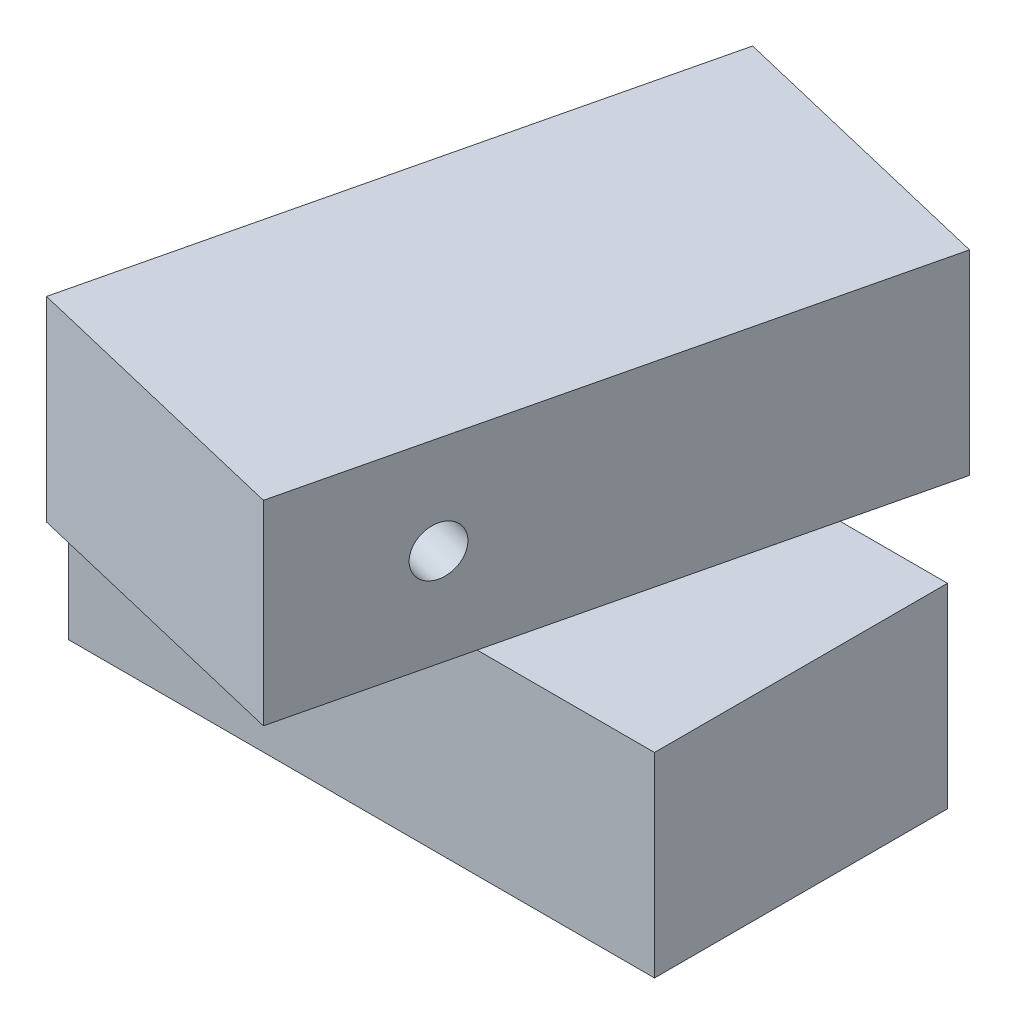
ISO-10303-21;
HEADER;
FILE_DESCRIPTION(('STEP AP214'),'2;1');
FILE_NAME('part.step','',(''),(''),'','','');
FILE_SCHEMA(('AUTOMOTIVE_DESIGN { 1 0 10303 214 1 1 1 1 }'));
ENDSEC;
DATA;
#1=APPLICATION_CONTEXT('core data for automotive mechanical design processes');
#2=APPLICATION_PROTOCOL_DEFINITION('international standard','automotive_design',2000,#1);
#3=PRODUCT_CONTEXT('',#1,'mechanical');
#4=PRODUCT('Part','Part','',(#3));
#5=PRODUCT_RELATED_PRODUCT_CATEGORY('part','',(#4));
#6=PRODUCT_DEFINITION_FORMATION('','',#4);
#7=PRODUCT_DEFINITION_CONTEXT('part definition',#1,'design');
#8=PRODUCT_DEFINITION('design','',#6,#7);
#9=PRODUCT_DEFINITION_SHAPE('','',#8);
#10=(LENGTH_UNIT() NAMED_UNIT(*) SI_UNIT(.MILLI.,.METRE.));
#11=(NAMED_UNIT(*) PLANE_ANGLE_UNIT() SI_UNIT($,.RADIAN.));
#12=(NAMED_UNIT(*) SI_UNIT($,.STERADIAN.) SOLID_ANGLE_UNIT());
#13=UNCERTAINTY_MEASURE_WITH_UNIT(LENGTH_MEASURE(1.E-05),#10,'distance_accuracy_value','');
#14=(GEOMETRIC_REPRESENTATION_CONTEXT(3) GLOBAL_UNCERTAINTY_ASSIGNED_CONTEXT((#13)) GLOBAL_UNIT_ASSIGNED_CONTEXT((#10,
#11,#12)) REPRESENTATION_CONTEXT('',''));
#15=CARTESIAN_POINT('',(0.,0.,0.));
#16=DIRECTION('',(0.,0.,1.));
#17=DIRECTION('',(1.,0.,0.));
#18=AXIS2_PLACEMENT_3D('',#15,#16,#17);
#19=CARTESIAN_POINT('',(-60.,20.,30.));
#20=DIRECTION('',(0.,-1.,0.));
#21=DIRECTION('',(0.,0.,-1.));
#22=AXIS2_PLACEMENT_3D('',#19,#20,#21);
#23=PLANE('',#22);
#24=DIRECTION('',(0.232341226421482,0.,-0.972634337510743));
#25=VECTOR('',#24,1.);
#26=CARTESIAN_POINT('',(43.1195037106112,20.,-51.3878234580001));
#27=LINE('',#26,#25);
#28=CARTESIAN_POINT('',(23.6777196929891,20.,30.));
#29=VERTEX_POINT('',#28);
#30=CARTESIAN_POINT('',(38.0104170363367,20.,-30.));
#31=VERTEX_POINT('',#30);
#32=EDGE_CURVE('E11',#29,#31,#27,.T.);
#33=ORIENTED_EDGE('',*,*,#32,.F.);
#34=DIRECTION('',(-1.,0.,0.));
#35=VECTOR('',#34,1.);
#36=CARTESIAN_POINT('',(-60.,20.,30.));
#37=LINE('',#36,#35);
#38=CARTESIAN_POINT('',(60.,20.,30.));
#39=VERTEX_POINT('',#38);
#40=EDGE_CURVE('E152',#39,#29,#37,.T.);
#41=ORIENTED_EDGE('',*,*,#40,.F.);
#42=DIRECTION('',(0.,0.,-1.));
#43=VECTOR('',#42,1.);
#44=CARTESIAN_POINT('',(60.,20.,30.));
#45=LINE('',#44,#43);
#46=CARTESIAN_POINT('',(60.,20.,-30.));
#47=VERTEX_POINT('',#46);
#48=EDGE_CURVE('E37',#39,#47,#45,.T.);
#49=ORIENTED_EDGE('',*,*,#48,.T.);
#50=DIRECTION('',(-1.,0.,0.));
#51=VECTOR('',#50,1.);
#52=CARTESIAN_POINT('',(-60.,20.,-30.));
#53=LINE('',#52,#51);
#54=EDGE_CURVE('E160',#47,#31,#53,.T.);
#55=ORIENTED_EDGE('',*,*,#54,.T.);
#56=EDGE_LOOP('',(#33,#41,#49,#55));
#57=FACE_BOUND('',#56,.T.);
#58=ADVANCED_FACE('F33',(#57),#23,.F.);
#59=DIRECTION('',(-0.232341226421482,0.,0.972634337510743));
#60=VECTOR('',#59,1.);
#61=CARTESIAN_POINT('',(-15.2385565400334,20.,-65.328297043289));
#62=LINE('',#61,#60);
#63=CARTESIAN_POINT('',(-23.6777196929891,20.,-30.));
#64=VERTEX_POINT('',#63);
#65=CARTESIAN_POINT('',(-38.0104170363368,20.,30.));
#66=VERTEX_POINT('',#65);
#67=EDGE_CURVE('E42',#64,#66,#62,.T.);
#68=ORIENTED_EDGE('',*,*,#67,.F.);
#69=CARTESIAN_POINT('',(-60.,20.,-30.));
#70=VERTEX_POINT('',#69);
#71=EDGE_CURVE('E141',#64,#70,#53,.T.);
#72=ORIENTED_EDGE('',*,*,#71,.T.);
#73=DIRECTION('',(0.,0.,-1.));
#74=VECTOR('',#73,1.);
#75=CARTESIAN_POINT('',(-60.,20.,30.));
#76=LINE('',#75,#74);
#77=CARTESIAN_POINT('',(-60.,20.,30.));
#78=VERTEX_POINT('',#77);
#79=EDGE_CURVE('E170',#78,#70,#76,.T.);
#80=ORIENTED_EDGE('',*,*,#79,.F.);
#81=EDGE_CURVE('E150',#66,#78,#37,.T.);
#82=ORIENTED_EDGE('',*,*,#81,.F.);
#83=EDGE_LOOP('',(#68,#72,#80,#82));
#84=FACE_BOUND('',#83,.T.);
#85=ADVANCED_FACE('F217',(#84),#23,.F.);
#86=CARTESIAN_POINT('',(60.,-20.,30.));
#87=DIRECTION('',(-1.,0.,0.));
#88=DIRECTION('',(0.,0.,1.));
#89=AXIS2_PLACEMENT_3D('',#86,#87,#88);
#90=PLANE('',#89);
#91=DIRECTION('',(0.,1.,0.));
#92=VECTOR('',#91,1.);
#93=CARTESIAN_POINT('',(60.,-20.,-30.));
#94=LINE('',#93,#92);
#95=CARTESIAN_POINT('',(60.,-20.,-30.));
#96=VERTEX_POINT('',#95);
#97=EDGE_CURVE('E138',#96,#47,#94,.T.);
#98=ORIENTED_EDGE('',*,*,#97,.T.);
#99=ORIENTED_EDGE('',*,*,#48,.F.);
#100=DIRECTION('',(0.,1.,0.));
#101=VECTOR('',#100,1.);
#102=CARTESIAN_POINT('',(60.,-20.,30.));
#103=LINE('',#102,#101);
#104=CARTESIAN_POINT('',(60.,-20.,30.));
#105=VERTEX_POINT('',#104);
#106=EDGE_CURVE('E147',#105,#39,#103,.T.);
#107=ORIENTED_EDGE('',*,*,#106,.F.);
#108=DIRECTION('',(0.,0.,-1.));
#109=VECTOR('',#108,1.);
#110=CARTESIAN_POINT('',(60.,-20.,30.));
#111=LINE('',#110,#109);
#112=EDGE_CURVE('E158',#105,#96,#111,.T.);
#113=ORIENTED_EDGE('',*,*,#112,.T.);
#114=EDGE_LOOP('',(#98,#99,#107,#113));
#115=FACE_BOUND('',#114,.T.);
#116=ADVANCED_FACE('F35',(#115),#90,.F.);
#117=CARTESIAN_POINT('',(-60.,-20.,30.));
#118=DIRECTION('',(1.,0.,0.));
#119=DIRECTION('',(0.,0.,-1.));
#120=AXIS2_PLACEMENT_3D('',#117,#118,#119);
#121=PLANE('',#120);
#122=DIRECTION('',(0.,-1.,0.));
#123=VECTOR('',#122,1.);
#124=CARTESIAN_POINT('',(-60.,-20.,-30.));
#125=LINE('',#124,#123);
#126=CARTESIAN_POINT('',(-60.,-20.,-30.));
#127=VERTEX_POINT('',#126);
#128=EDGE_CURVE('E162',#70,#127,#125,.T.);
#129=ORIENTED_EDGE('',*,*,#128,.T.);
#130=DIRECTION('',(0.,0.,-1.));
#131=VECTOR('',#130,1.);
#132=CARTESIAN_POINT('',(-60.,-20.,30.));
#133=LINE('',#132,#131);
#134=CARTESIAN_POINT('',(-60.,-20.,30.));
#135=VERTEX_POINT('',#134);
#136=EDGE_CURVE('E168',#135,#127,#133,.T.);
#137=ORIENTED_EDGE('',*,*,#136,.F.);
#138=DIRECTION('',(0.,-1.,0.));
#139=VECTOR('',#138,1.);
#140=CARTESIAN_POINT('',(-60.,-20.,30.));
#141=LINE('',#140,#139);
#142=EDGE_CURVE('E154',#78,#135,#141,.T.);
#143=ORIENTED_EDGE('',*,*,#142,.F.);
#144=ORIENTED_EDGE('',*,*,#79,.T.);
#145=EDGE_LOOP('',(#129,#137,#143,#144));
#146=FACE_BOUND('',#145,.T.);
#147=ADVANCED_FACE('F222',(#146),#121,.F.);
#148=CARTESIAN_POINT('',(-60.,-20.,30.));
#149=DIRECTION('',(0.,1.,0.));
#150=DIRECTION('',(0.,0.,1.));
#151=AXIS2_PLACEMENT_3D('',#148,#149,#150);
#152=PLANE('',#151);
#153=DIRECTION('',(1.,0.,0.));
#154=VECTOR('',#153,1.);
#155=CARTESIAN_POINT('',(-60.,-20.,-30.));
#156=LINE('',#155,#154);
#157=EDGE_CURVE('E151',#127,#96,#156,.T.);
#158=ORIENTED_EDGE('',*,*,#157,.T.);
#159=ORIENTED_EDGE('',*,*,#112,.F.);
#160=DIRECTION('',(1.,0.,0.));
#161=VECTOR('',#160,1.);
#162=CARTESIAN_POINT('',(-60.,-20.,30.));
#163=LINE('',#162,#161);
#164=EDGE_CURVE('E157',#135,#105,#163,.T.);
#165=ORIENTED_EDGE('',*,*,#164,.F.);
#166=ORIENTED_EDGE('',*,*,#136,.T.);
#167=EDGE_LOOP('',(#158,#159,#165,#166));
#168=FACE_BOUND('',#167,.T.);
#169=ADVANCED_FACE('F225',(#168),#152,.F.);
#170=CARTESIAN_POINT('',(0.,0.,30.));
#171=DIRECTION('',(0.,0.,-1.));
#172=DIRECTION('',(-1.,0.,0.));
#173=AXIS2_PLACEMENT_3D('',#170,#171,#172);
#174=PLANE('',#173);
#175=ORIENTED_EDGE('',*,*,#106,.T.);
#176=ORIENTED_EDGE('',*,*,#40,.T.);
#177=EDGE_CURVE('E155',#29,#66,#37,.T.);
#178=ORIENTED_EDGE('',*,*,#177,.T.);
#179=ORIENTED_EDGE('',*,*,#81,.T.);
#180=ORIENTED_EDGE('',*,*,#142,.T.);
#181=ORIENTED_EDGE('',*,*,#164,.T.);
#182=EDGE_LOOP('',(#175,#176,#178,#179,#180,#181));
#183=FACE_BOUND('',#182,.T.);
#184=ADVANCED_FACE('F229',(#183),#174,.F.);
#185=CARTESIAN_POINT('',(0.,0.,-30.));
#186=DIRECTION('',(0.,0.,-1.));
#187=DIRECTION('',(-1.,0.,0.));
#188=AXIS2_PLACEMENT_3D('',#185,#186,#187);
#189=PLANE('',#188);
#190=ORIENTED_EDGE('',*,*,#97,.F.);
#191=ORIENTED_EDGE('',*,*,#157,.F.);
#192=ORIENTED_EDGE('',*,*,#128,.F.);
#193=ORIENTED_EDGE('',*,*,#71,.F.);
#194=EDGE_CURVE('E163',#31,#64,#53,.T.);
#195=ORIENTED_EDGE('',*,*,#194,.F.);
#196=ORIENTED_EDGE('',*,*,#54,.F.);
#197=EDGE_LOOP('',(#190,#191,#192,#193,#195,#196));
#198=FACE_BOUND('',#197,.T.);
#199=ADVANCED_FACE('F219',(#198),#189,.T.);
#200=CARTESIAN_POINT('',(0.,20.,0.));
#201=DIRECTION('',(0.,-1.,0.));
#202=DIRECTION('',(0.,0.,-1.));
#203=AXIS2_PLACEMENT_3D('',#200,#201,#202);
#204=PLANE('',#203);
#205=ORIENTED_EDGE('',*,*,#177,.F.);
#206=CARTESIAN_POINT('',(15.2385565400334,20.,65.328297043289));
#207=VERTEX_POINT('',#206);
#208=EDGE_CURVE('E44',#207,#29,#27,.T.);
#209=ORIENTED_EDGE('',*,*,#208,.F.);
#210=DIRECTION('',(0.972634337510743,0.,0.232341226421482));
#211=VECTOR('',#210,1.);
#212=CARTESIAN_POINT('',(-43.1195037106112,20.,51.3878234580001));
#213=LINE('',#212,#211);
#214=CARTESIAN_POINT('',(-43.1195037106112,20.,51.3878234580001));
#215=VERTEX_POINT('',#214);
#216=EDGE_CURVE('E183',#215,#207,#213,.T.);
#217=ORIENTED_EDGE('',*,*,#216,.F.);
#218=EDGE_CURVE('E180',#66,#215,#62,.T.);
#219=ORIENTED_EDGE('',*,*,#218,.F.);
#220=EDGE_LOOP('',(#205,#209,#217,#219));
#221=FACE_BOUND('',#220,.T.);
#222=ADVANCED_FACE('F230',(#221),#204,.T.);
#223=CARTESIAN_POINT('',(-15.2385565400334,60.,-65.328297043289));
#224=DIRECTION('',(-0.232341226421481,0.,0.972634337510743));
#225=DIRECTION('',(0.972634337510743,0.,0.232341226421481));
#226=AXIS2_PLACEMENT_3D('',#223,#224,#225);
#227=PLANE('',#226);
#228=DIRECTION('',(-0.972634337510743,0.,-0.232341226421481));
#229=VECTOR('',#228,1.);
#230=CARTESIAN_POINT('',(-15.2385565400334,20.,-65.328297043289));
#231=LINE('',#230,#229);
#232=CARTESIAN_POINT('',(43.1195037106112,20.,-51.3878234580001));
#233=VERTEX_POINT('',#232);
#234=CARTESIAN_POINT('',(-15.2385565400334,20.,-65.328297043289));
#235=VERTEX_POINT('',#234);
#236=EDGE_CURVE('E137',#233,#235,#231,.T.);
#237=ORIENTED_EDGE('',*,*,#236,.T.);
#238=DIRECTION('',(0.,-1.,0.));
#239=VECTOR('',#238,1.);
#240=CARTESIAN_POINT('',(-15.2385565400334,60.,-65.328297043289));
#241=LINE('',#240,#239);
#242=CARTESIAN_POINT('',(-15.2385565400334,60.,-65.328297043289));
#243=VERTEX_POINT('',#242);
#244=EDGE_CURVE('E118',#243,#235,#241,.T.);
#245=ORIENTED_EDGE('',*,*,#244,.F.);
#246=DIRECTION('',(-0.972634337510743,0.,-0.232341226421481));
#247=VECTOR('',#246,1.);
#248=CARTESIAN_POINT('',(-15.2385565400334,60.,-65.328297043289));
#249=LINE('',#248,#247);
#250=CARTESIAN_POINT('',(43.1195037106112,60.,-51.3878234580001));
#251=VERTEX_POINT('',#250);
#252=EDGE_CURVE('E125',#251,#243,#249,.T.);
#253=ORIENTED_EDGE('',*,*,#252,.F.);
#254=DIRECTION('',(0.,-1.,0.));
#255=VECTOR('',#254,1.);
#256=CARTESIAN_POINT('',(43.1195037106112,60.,-51.3878234580001));
#257=LINE('',#256,#255);
#258=EDGE_CURVE('E191',#251,#233,#257,.T.);
#259=ORIENTED_EDGE('',*,*,#258,.T.);
#260=EDGE_LOOP('',(#237,#245,#253,#259));
#261=FACE_BOUND('',#260,.T.);
#262=ADVANCED_FACE('F135',(#261),#227,.F.);
#263=CARTESIAN_POINT('',(-15.2385565400334,60.,-65.328297043289));
#264=DIRECTION('',(0.972634337510743,0.,0.232341226421482));
#265=DIRECTION('',(0.232341226421482,0.,-0.972634337510743));
#266=AXIS2_PLACEMENT_3D('',#263,#264,#265);
#267=PLANE('',#266);
#268=CARTESIAN_POINT('',(-36.204693437049,40.,22.4408216149521));
#269=DIRECTION('',(0.972634337510743,0.,0.232341226421482));
#270=DIRECTION('',(0.232341226421482,0.,-0.972634337510743));
#271=AXIS2_PLACEMENT_3D('',#268,#269,#270);
#272=CIRCLE('',#271,5.00000000000001);
#273=CARTESIAN_POINT('',(-35.0429873049416,40.,17.5776499273983));
#274=VERTEX_POINT('',#273);
#275=EDGE_CURVE('E185',#274,#274,#272,.T.);
#276=ORIENTED_EDGE('',*,*,#275,.T.);
#277=EDGE_LOOP('',(#276));
#278=FACE_BOUND('',#277,.T.);
#279=EDGE_CURVE('E179',#235,#64,#62,.T.);
#280=ORIENTED_EDGE('',*,*,#279,.T.);
#281=ORIENTED_EDGE('',*,*,#67,.T.);
#282=ORIENTED_EDGE('',*,*,#218,.T.);
#283=DIRECTION('',(0.,-1.,0.));
#284=VECTOR('',#283,1.);
#285=CARTESIAN_POINT('',(-43.1195037106112,60.,51.3878234580001));
#286=LINE('',#285,#284);
#287=CARTESIAN_POINT('',(-43.1195037106112,60.,51.3878234580001));
#288=VERTEX_POINT('',#287);
#289=EDGE_CURVE('E121',#288,#215,#286,.T.);
#290=ORIENTED_EDGE('',*,*,#289,.F.);
#291=DIRECTION('',(-0.232341226421482,0.,0.972634337510743));
#292=VECTOR('',#291,1.);
#293=CARTESIAN_POINT('',(-15.2385565400334,60.,-65.328297043289));
#294=LINE('',#293,#292);
#295=EDGE_CURVE('E113',#243,#288,#294,.T.);
#296=ORIENTED_EDGE('',*,*,#295,.F.);
#297=ORIENTED_EDGE('',*,*,#244,.T.);
#298=EDGE_LOOP('',(#280,#281,#282,#290,#296,#297));
#299=FACE_BOUND('',#298,.T.);
#300=ADVANCED_FACE('F116',(#278,#299),#267,.F.);
#301=CARTESIAN_POINT('',(-43.1195037106112,60.,51.3878234580001));
#302=DIRECTION('',(0.232341226421482,0.,-0.972634337510743));
#303=DIRECTION('',(-0.972634337510743,0.,-0.232341226421482));
#304=AXIS2_PLACEMENT_3D('',#301,#302,#303);
#305=PLANE('',#304);
#306=ORIENTED_EDGE('',*,*,#216,.T.);
#307=DIRECTION('',(0.,-1.,0.));
#308=VECTOR('',#307,1.);
#309=CARTESIAN_POINT('',(15.2385565400334,60.,65.328297043289));
#310=LINE('',#309,#308);
#311=CARTESIAN_POINT('',(15.2385565400334,60.,65.328297043289));
#312=VERTEX_POINT('',#311);
#313=EDGE_CURVE('E143',#312,#207,#310,.T.);
#314=ORIENTED_EDGE('',*,*,#313,.F.);
#315=DIRECTION('',(0.972634337510743,0.,0.232341226421482));
#316=VECTOR('',#315,1.);
#317=CARTESIAN_POINT('',(-43.1195037106112,60.,51.3878234580001));
#318=LINE('',#317,#316);
#319=EDGE_CURVE('E124',#288,#312,#318,.T.);
#320=ORIENTED_EDGE('',*,*,#319,.F.);
#321=ORIENTED_EDGE('',*,*,#289,.T.);
#322=EDGE_LOOP('',(#306,#314,#320,#321));
#323=FACE_BOUND('',#322,.T.);
#324=ADVANCED_FACE('F202',(#323),#305,.F.);
#325=CARTESIAN_POINT('',(43.1195037106112,60.,-51.3878234580001));
#326=DIRECTION('',(-0.972634337510743,0.,-0.232341226421482));
#327=DIRECTION('',(-0.232341226421482,0.,0.972634337510743));
#328=AXIS2_PLACEMENT_3D('',#325,#326,#327);
#329=PLANE('',#328);
#330=CARTESIAN_POINT('',(22.1533668135956,40.,36.381295200241));
#331=DIRECTION('',(0.972634337510743,0.,0.232341226421482));
#332=DIRECTION('',(0.232341226421482,0.,-0.972634337510743));
#333=AXIS2_PLACEMENT_3D('',#330,#331,#332);
#334=CIRCLE('',#333,5.00000000000001);
#335=CARTESIAN_POINT('',(23.315072945703,40.,31.5181235126872));
#336=VERTEX_POINT('',#335);
#337=EDGE_CURVE('E187',#336,#336,#334,.T.);
#338=ORIENTED_EDGE('',*,*,#337,.F.);
#339=EDGE_LOOP('',(#338));
#340=FACE_BOUND('',#339,.T.);
#341=ORIENTED_EDGE('',*,*,#208,.T.);
#342=ORIENTED_EDGE('',*,*,#32,.T.);
#343=EDGE_CURVE('E45',#31,#233,#27,.T.);
#344=ORIENTED_EDGE('',*,*,#343,.T.);
#345=ORIENTED_EDGE('',*,*,#258,.F.);
#346=DIRECTION('',(0.232341226421482,0.,-0.972634337510743));
#347=VECTOR('',#346,1.);
#348=CARTESIAN_POINT('',(43.1195037106112,60.,-51.3878234580001));
#349=LINE('',#348,#347);
#350=EDGE_CURVE('E130',#312,#251,#349,.T.);
#351=ORIENTED_EDGE('',*,*,#350,.F.);
#352=ORIENTED_EDGE('',*,*,#313,.T.);
#353=EDGE_LOOP('',(#341,#342,#344,#345,#351,#352));
#354=FACE_BOUND('',#353,.T.);
#355=ADVANCED_FACE('F199',(#340,#354),#329,.F.);
#356=CARTESIAN_POINT('',(0.,60.,0.));
#357=DIRECTION('',(0.,-1.,0.));
#358=DIRECTION('',(0.,0.,-1.));
#359=AXIS2_PLACEMENT_3D('',#356,#357,#358);
#360=PLANE('',#359);
#361=ORIENTED_EDGE('',*,*,#252,.T.);
#362=ORIENTED_EDGE('',*,*,#295,.T.);
#363=ORIENTED_EDGE('',*,*,#319,.T.);
#364=ORIENTED_EDGE('',*,*,#350,.T.);
#365=EDGE_LOOP('',(#361,#362,#363,#364));
#366=FACE_BOUND('',#365,.T.);
#367=ADVANCED_FACE('F128',(#366),#360,.F.);
#368=ORIENTED_EDGE('',*,*,#343,.F.);
#369=ORIENTED_EDGE('',*,*,#194,.T.);
#370=ORIENTED_EDGE('',*,*,#279,.F.);
#371=ORIENTED_EDGE('',*,*,#236,.F.);
#372=EDGE_LOOP('',(#368,#369,#370,#371));
#373=FACE_BOUND('',#372,.T.);
#374=ADVANCED_FACE('F214',(#373),#204,.T.);
#375=CARTESIAN_POINT('',(-78.5498047151587,40.,12.32549388296));
#376=DIRECTION('',(0.972634337510743,0.,0.232341226421482));
#377=DIRECTION('',(0.232341226421482,0.,-0.972634337510743));
#378=AXIS2_PLACEMENT_3D('',#375,#376,#377);
#379=CYLINDRICAL_SURFACE('',#378,5.00000000000001);
#380=ORIENTED_EDGE('',*,*,#337,.T.);
#381=EDGE_LOOP('',(#380));
#382=FACE_BOUND('',#381,.T.);
#383=ORIENTED_EDGE('',*,*,#275,.F.);
#384=EDGE_LOOP('',(#383));
#385=FACE_BOUND('',#384,.T.);
#386=ADVANCED_FACE('F196',(#382,#385),#379,.F.);
#387=CLOSED_SHELL('',(#58,#85,#116,#147,#169,#184,#199,#222,#262,#300,#324,#355,#367,#374,#386));
#388=MANIFOLD_SOLID_BREP('B2',#387);
#389=ADVANCED_BREP_SHAPE_REPRESENTATION('',(#18,#388),#14);
#390=SHAPE_DEFINITION_REPRESENTATION(#9,#389);
ENDSEC;
END-ISO-10303-21;
